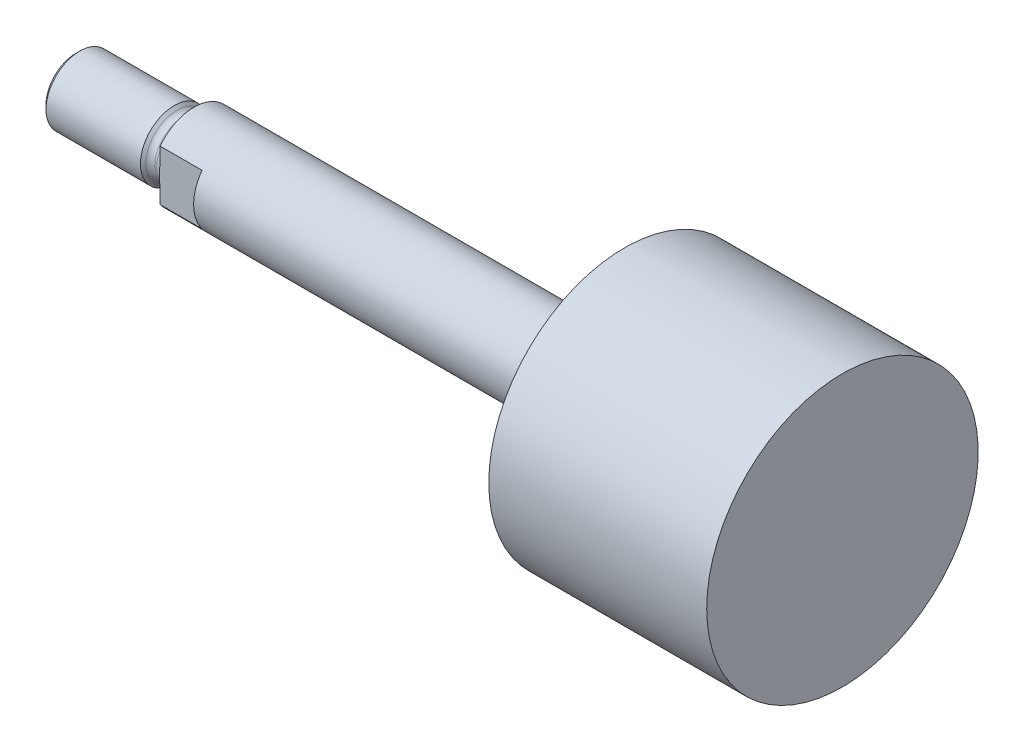
ISO-10303-21;
HEADER;
FILE_DESCRIPTION(('STEP AP214'),'2;1');
FILE_NAME('part.step','',(''),(''),'','','');
FILE_SCHEMA(('AUTOMOTIVE_DESIGN { 1 0 10303 214 1 1 1 1 }'));
ENDSEC;
DATA;
#1=APPLICATION_CONTEXT('core data for automotive mechanical design processes');
#2=APPLICATION_PROTOCOL_DEFINITION('international standard','automotive_design',2000,#1);
#3=PRODUCT_CONTEXT('',#1,'mechanical');
#4=PRODUCT('Part','Part','',(#3));
#5=PRODUCT_RELATED_PRODUCT_CATEGORY('part','',(#4));
#6=PRODUCT_DEFINITION_FORMATION('','',#4);
#7=PRODUCT_DEFINITION_CONTEXT('part definition',#1,'design');
#8=PRODUCT_DEFINITION('design','',#6,#7);
#9=PRODUCT_DEFINITION_SHAPE('','',#8);
#10=(LENGTH_UNIT() NAMED_UNIT(*) SI_UNIT(.MILLI.,.METRE.));
#11=(NAMED_UNIT(*) PLANE_ANGLE_UNIT() SI_UNIT($,.RADIAN.));
#12=(NAMED_UNIT(*) SI_UNIT($,.STERADIAN.) SOLID_ANGLE_UNIT());
#13=UNCERTAINTY_MEASURE_WITH_UNIT(LENGTH_MEASURE(1.E-05),#10,'distance_accuracy_value','');
#14=(GEOMETRIC_REPRESENTATION_CONTEXT(3) GLOBAL_UNCERTAINTY_ASSIGNED_CONTEXT((#13)) GLOBAL_UNIT_ASSIGNED_CONTEXT((#10,
#11,#12)) REPRESENTATION_CONTEXT('',''));
#15=CARTESIAN_POINT('',(0.,0.,0.));
#16=DIRECTION('',(0.,0.,1.));
#17=DIRECTION('',(1.,0.,0.));
#18=AXIS2_PLACEMENT_3D('',#15,#16,#17);
#19=CARTESIAN_POINT('',(-9.525,0.,0.));
#20=DIRECTION('',(1.,0.,0.));
#21=DIRECTION('',(0.,0.,-1.));
#22=AXIS2_PLACEMENT_3D('',#19,#20,#21);
#23=PLANE('',#22);
#24=CARTESIAN_POINT('',(-9.52500000000001,0.,0.));
#25=DIRECTION('',(-1.,0.,0.));
#26=DIRECTION('',(0.,0.,1.));
#27=AXIS2_PLACEMENT_3D('',#24,#25,#26);
#28=CIRCLE('',#27,7.9375);
#29=CARTESIAN_POINT('',(-9.52500000000001,-4.7625,-6.35));
#30=VERTEX_POINT('',#29);
#31=CARTESIAN_POINT('',(-9.52500000000001,-4.7625,6.35));
#32=VERTEX_POINT('',#31);
#33=EDGE_CURVE('E106',#30,#32,#28,.T.);
#34=ORIENTED_EDGE('',*,*,#33,.T.);
#35=DIRECTION('',(0.,1.,0.));
#36=VECTOR('',#35,1.);
#37=CARTESIAN_POINT('',(-9.525,0.,6.35));
#38=LINE('',#37,#36);
#39=CARTESIAN_POINT('',(-9.52499999999909,-2.97038855370794,6.35));
#40=VERTEX_POINT('',#39);
#41=EDGE_CURVE('E114',#32,#40,#38,.T.);
#42=ORIENTED_EDGE('',*,*,#41,.T.);
#43=CARTESIAN_POINT('',(-9.525,0.,0.));
#44=DIRECTION('',(-1.,0.,0.));
#45=DIRECTION('',(0.,0.,1.));
#46=AXIS2_PLACEMENT_3D('',#43,#44,#45);
#47=CIRCLE('',#46,7.01039999999997);
#48=CARTESIAN_POINT('',(-9.525,-2.970388553708,-6.35));
#49=VERTEX_POINT('',#48);
#50=EDGE_CURVE('E149',#49,#40,#47,.T.);
#51=ORIENTED_EDGE('',*,*,#50,.F.);
#52=DIRECTION('',(0.,-1.,0.));
#53=VECTOR('',#52,1.);
#54=CARTESIAN_POINT('',(-9.525,0.,-6.35));
#55=LINE('',#54,#53);
#56=EDGE_CURVE('E51',#49,#30,#55,.T.);
#57=ORIENTED_EDGE('',*,*,#56,.T.);
#58=EDGE_LOOP('',(#34,#42,#51,#57));
#59=FACE_BOUND('',#58,.T.);
#60=ADVANCED_FACE('F36',(#59),#23,.F.);
#61=CARTESIAN_POINT('',(-9.525,2.970388553708,6.35));
#62=VERTEX_POINT('',#61);
#63=CARTESIAN_POINT('',(-9.52499999999909,2.97038855370794,-6.35));
#64=VERTEX_POINT('',#63);
#65=EDGE_CURVE('E150',#62,#64,#47,.T.);
#66=ORIENTED_EDGE('',*,*,#65,.F.);
#67=CARTESIAN_POINT('',(-9.52500000000001,4.7625,6.35));
#68=VERTEX_POINT('',#67);
#69=EDGE_CURVE('E59',#62,#68,#38,.T.);
#70=ORIENTED_EDGE('',*,*,#69,.T.);
#71=CARTESIAN_POINT('',(-9.52500000000001,4.7625,-6.35));
#72=VERTEX_POINT('',#71);
#73=EDGE_CURVE('E147',#68,#72,#28,.T.);
#74=ORIENTED_EDGE('',*,*,#73,.T.);
#75=EDGE_CURVE('E107',#72,#64,#55,.T.);
#76=ORIENTED_EDGE('',*,*,#75,.T.);
#77=EDGE_LOOP('',(#66,#70,#74,#76));
#78=FACE_BOUND('',#77,.T.);
#79=ADVANCED_FACE('F38',(#78),#23,.F.);
#80=CARTESIAN_POINT('',(112.395,0.,0.));
#81=DIRECTION('',(-1.,0.,0.));
#82=DIRECTION('',(0.,0.,1.));
#83=AXIS2_PLACEMENT_3D('',#80,#81,#82);
#84=CYLINDRICAL_SURFACE('',#83,7.9375);
#85=DIRECTION('',(-1.,0.,0.));
#86=VECTOR('',#85,1.);
#87=CARTESIAN_POINT('',(112.395,4.7625,-6.35));
#88=LINE('',#87,#86);
#89=CARTESIAN_POINT('',(-1.651,4.7625,-6.35));
#90=VERTEX_POINT('',#89);
#91=EDGE_CURVE('E99',#90,#72,#88,.T.);
#92=ORIENTED_EDGE('',*,*,#91,.T.);
#93=ORIENTED_EDGE('',*,*,#73,.F.);
#94=DIRECTION('',(-1.,0.,0.));
#95=VECTOR('',#94,1.);
#96=CARTESIAN_POINT('',(112.395,4.7625,6.35));
#97=LINE('',#96,#95);
#98=CARTESIAN_POINT('',(-1.651,4.7625,6.35));
#99=VERTEX_POINT('',#98);
#100=EDGE_CURVE('E115',#68,#99,#97,.F.);
#101=ORIENTED_EDGE('',*,*,#100,.T.);
#102=CARTESIAN_POINT('',(-1.651,0.,0.));
#103=DIRECTION('',(1.,0.,0.));
#104=DIRECTION('',(0.,0.,-1.));
#105=AXIS2_PLACEMENT_3D('',#102,#103,#104);
#106=CIRCLE('',#105,7.9375);
#107=CARTESIAN_POINT('',(-1.651,-4.7625,6.35));
#108=VERTEX_POINT('',#107);
#109=EDGE_CURVE('E11',#99,#108,#106,.T.);
#110=ORIENTED_EDGE('',*,*,#109,.T.);
#111=DIRECTION('',(-1.,0.,0.));
#112=VECTOR('',#111,1.);
#113=CARTESIAN_POINT('',(112.395,-4.7625,6.35));
#114=LINE('',#113,#112);
#115=EDGE_CURVE('E118',#108,#32,#114,.T.);
#116=ORIENTED_EDGE('',*,*,#115,.T.);
#117=ORIENTED_EDGE('',*,*,#33,.F.);
#118=DIRECTION('',(-1.,0.,0.));
#119=VECTOR('',#118,1.);
#120=CARTESIAN_POINT('',(112.395,-4.7625,-6.35));
#121=LINE('',#120,#119);
#122=CARTESIAN_POINT('',(-1.651,-4.7625,-6.35));
#123=VERTEX_POINT('',#122);
#124=EDGE_CURVE('E97',#30,#123,#121,.F.);
#125=ORIENTED_EDGE('',*,*,#124,.T.);
#126=EDGE_CURVE('E40',#123,#90,#106,.T.);
#127=ORIENTED_EDGE('',*,*,#126,.T.);
#128=EDGE_LOOP('',(#92,#93,#101,#110,#116,#117,#125,#127));
#129=FACE_BOUND('',#128,.T.);
#130=CARTESIAN_POINT('',(71.4248,0.,0.));
#131=DIRECTION('',(-1.,0.,0.));
#132=DIRECTION('',(0.,0.,1.));
#133=AXIS2_PLACEMENT_3D('',#130,#131,#132);
#134=CIRCLE('',#133,7.9375);
#135=CARTESIAN_POINT('',(71.4248,0.,7.9375));
#136=VERTEX_POINT('',#135);
#137=EDGE_CURVE('E144',#136,#136,#134,.T.);
#138=ORIENTED_EDGE('',*,*,#137,.T.);
#139=EDGE_LOOP('',(#138));
#140=FACE_BOUND('',#139,.T.);
#141=ADVANCED_FACE('F103',(#129,#140),#84,.T.);
#142=CARTESIAN_POINT('',(71.4248,7.9375,0.));
#143=DIRECTION('',(1.,0.,0.));
#144=DIRECTION('',(0.,0.,-1.));
#145=AXIS2_PLACEMENT_3D('',#142,#143,#144);
#146=PLANE('',#145);
#147=ORIENTED_EDGE('',*,*,#137,.F.);
#148=EDGE_LOOP('',(#147));
#149=FACE_BOUND('',#148,.T.);
#150=CARTESIAN_POINT('',(71.4248,0.,0.));
#151=DIRECTION('',(-1.,0.,0.));
#152=DIRECTION('',(0.,0.,1.));
#153=AXIS2_PLACEMENT_3D('',#150,#151,#152);
#154=CIRCLE('',#153,25.52065);
#155=CARTESIAN_POINT('',(71.4248,0.,25.52065));
#156=VERTEX_POINT('',#155);
#157=EDGE_CURVE('E141',#156,#156,#154,.T.);
#158=ORIENTED_EDGE('',*,*,#157,.T.);
#159=EDGE_LOOP('',(#158));
#160=FACE_BOUND('',#159,.T.);
#161=ADVANCED_FACE('F223',(#149,#160),#146,.F.);
#162=CARTESIAN_POINT('',(112.395,0.,0.));
#163=DIRECTION('',(-1.,0.,0.));
#164=DIRECTION('',(0.,0.,1.));
#165=AXIS2_PLACEMENT_3D('',#162,#163,#164);
#166=CYLINDRICAL_SURFACE('',#165,25.52065);
#167=ORIENTED_EDGE('',*,*,#157,.F.);
#168=EDGE_LOOP('',(#167));
#169=FACE_BOUND('',#168,.T.);
#170=CARTESIAN_POINT('',(112.395,0.,0.));
#171=DIRECTION('',(-1.,0.,0.));
#172=DIRECTION('',(0.,0.,1.));
#173=AXIS2_PLACEMENT_3D('',#170,#171,#172);
#174=CIRCLE('',#173,25.52065);
#175=CARTESIAN_POINT('',(112.395,0.,25.52065));
#176=VERTEX_POINT('',#175);
#177=EDGE_CURVE('E138',#176,#176,#174,.T.);
#178=ORIENTED_EDGE('',*,*,#177,.T.);
#179=EDGE_LOOP('',(#178));
#180=FACE_BOUND('',#179,.T.);
#181=ADVANCED_FACE('F227',(#169,#180),#166,.T.);
#182=CARTESIAN_POINT('',(112.395,25.52065,0.));
#183=DIRECTION('',(-1.,0.,0.));
#184=DIRECTION('',(0.,0.,1.));
#185=AXIS2_PLACEMENT_3D('',#182,#183,#184);
#186=PLANE('',#185);
#187=ORIENTED_EDGE('',*,*,#177,.F.);
#188=EDGE_LOOP('',(#187));
#189=FACE_BOUND('',#188,.T.);
#190=ADVANCED_FACE('F200',(#189),#186,.F.);
#191=CARTESIAN_POINT('',(-11.176,0.,0.));
#192=DIRECTION('',(-1.,0.,0.));
#193=DIRECTION('',(0.,0.,1.));
#194=AXIS2_PLACEMENT_3D('',#191,#192,#193);
#195=TOROIDAL_SURFACE('',#194,7.01039999999997,1.65099999999996);
#196=CARTESIAN_POINT('',(-11.176,0.,0.));
#197=DIRECTION('',(-1.,0.,0.));
#198=DIRECTION('',(0.,0.,1.));
#199=AXIS2_PLACEMENT_3D('',#196,#197,#198);
#200=CIRCLE('',#199,5.3594);
#201=CARTESIAN_POINT('',(-11.176,0.,5.3594));
#202=VERTEX_POINT('',#201);
#203=EDGE_CURVE('E135',#202,#202,#200,.T.);
#204=ORIENTED_EDGE('',*,*,#203,.F.);
#205=EDGE_LOOP('',(#204));
#206=FACE_BOUND('',#205,.T.);
#207=ORIENTED_EDGE('',*,*,#50,.T.);
#208=CARTESIAN_POINT('',(-9.66283350552548,0.,6.35));
#209=CARTESIAN_POINT('',(-9.66283776268165,0.137451430435917,6.35));
#210=CARTESIAN_POINT('',(-9.66086064410943,0.274901459292685,6.35));
#211=CARTESIAN_POINT('',(-9.65327512758972,0.549703593251603,6.35));
#212=CARTESIAN_POINT('',(-9.64766654215389,0.687055692931226,6.35));
#213=CARTESIAN_POINT('',(-9.63368350744831,0.961784555362044,6.35));
#214=CARTESIAN_POINT('',(-9.62530558703981,1.09916113170582,6.35));
#215=CARTESIAN_POINT('',(-9.60709506531702,1.37381514567713,6.35));
#216=CARTESIAN_POINT('',(-9.59726243721363,1.51109258143215,6.35));
#217=CARTESIAN_POINT('',(-9.57769107415581,1.78610658716269,6.35));
#218=CARTESIAN_POINT('',(-9.56795275241811,1.92384318770572,6.35));
#219=CARTESIAN_POINT('',(-9.55036706332895,2.1994349590825,6.35));
#220=CARTESIAN_POINT('',(-9.54251954822724,2.33729011980641,6.35));
#221=CARTESIAN_POINT('',(-9.53061012777387,2.61293672942961,6.35));
#222=CARTESIAN_POINT('',(-9.52654157628171,2.75072786256873,6.35));
#223=CARTESIAN_POINT('',(-9.52417014087122,3.02639632048793,6.35));
#224=CARTESIAN_POINT('',(-9.52586736602664,3.16427364684923,6.35));
#225=CARTESIAN_POINT('',(-9.53623298695597,3.41591615679577,6.35));
#226=CARTESIAN_POINT('',(-9.54364547741073,3.52972902878415,6.35));
#227=CARTESIAN_POINT('',(-9.5652722959771,3.75668651680819,6.35));
#228=CARTESIAN_POINT('',(-9.57948360173495,3.8698314071859,6.35));
#229=CARTESIAN_POINT('',(-9.61613724000463,4.09430765509806,6.35));
#230=CARTESIAN_POINT('',(-9.63854290816065,4.20564481854687,6.35));
#231=CARTESIAN_POINT('',(-9.69323725421695,4.42580807481177,6.35));
#232=CARTESIAN_POINT('',(-9.72551563503527,4.53463665746051,6.35));
#233=CARTESIAN_POINT('',(-9.80043395264561,4.74434521790355,6.35));
#234=CARTESIAN_POINT('',(-9.84265936849043,4.84537030063758,6.35));
#235=CARTESIAN_POINT('',(-9.93986578771073,5.04143487335471,6.35));
#236=CARTESIAN_POINT('',(-9.99486731550324,5.13646441596393,6.35));
#237=CARTESIAN_POINT('',(-10.1200822564968,5.31808438255421,6.35));
#238=CARTESIAN_POINT('',(-10.1904956953232,5.40453978365148,6.35));
#239=CARTESIAN_POINT('',(-10.3469450411392,5.56188873080202,6.35));
#240=CARTESIAN_POINT('',(-10.4329191525452,5.63284146617137,6.35));
#241=CARTESIAN_POINT('',(-10.5840425675886,5.72981578158812,6.35));
#242=CARTESIAN_POINT('',(-10.6448142215812,5.76269017456242,6.35));
#243=CARTESIAN_POINT('',(-10.7709599511927,5.81803002255515,6.35));
#244=CARTESIAN_POINT('',(-10.8363311031553,5.84050202217993,6.35));
#245=CARTESIAN_POINT('',(-10.9704057837701,5.87363179910374,6.35));
#246=CARTESIAN_POINT('',(-11.0391250807995,5.88422658965699,6.35));
#247=CARTESIAN_POINT('',(-11.177340641629,5.89257253132415,6.35));
#248=CARTESIAN_POINT('',(-11.2468367101593,5.89032684097418,6.35));
#249=CARTESIAN_POINT('',(-11.3787070331634,5.87387551024288,6.35));
#250=CARTESIAN_POINT('',(-11.4412061552369,5.86064135459059,6.35));
#251=CARTESIAN_POINT('',(-11.5632476514794,5.82431208557844,6.35));
#252=CARTESIAN_POINT('',(-11.6227895241345,5.8012153059669,6.35));
#253=CARTESIAN_POINT('',(-11.7403800522129,5.74515145636776,6.35));
#254=CARTESIAN_POINT('',(-11.7982335897206,5.71177873804436,6.35));
#255=CARTESIAN_POINT('',(-11.9086295249029,5.63724297521669,6.35));
#256=CARTESIAN_POINT('',(-11.9611700546148,5.59607720531773,6.35));
#257=CARTESIAN_POINT('',(-12.0874929348829,5.48357026818756,6.35));
#258=CARTESIAN_POINT('',(-12.1574533423658,5.40792695476672,6.35));
#259=CARTESIAN_POINT('',(-12.2844713443971,5.24641974614602,6.35));
#260=CARTESIAN_POINT('',(-12.3414880796921,5.16052475647974,6.35));
#261=CARTESIAN_POINT('',(-12.4707359307792,4.9347664739624,6.35));
#262=CARTESIAN_POINT('',(-12.5350669449757,4.79038507098147,6.35));
#263=CARTESIAN_POINT('',(-12.6144952020883,4.56826751975704,6.35));
#264=CARTESIAN_POINT('',(-12.638128174757,4.49329586638908,6.35));
#265=CARTESIAN_POINT('',(-12.6803779181948,4.34194457273481,6.35));
#266=CARTESIAN_POINT('',(-12.6989955499358,4.26556517652083,6.35));
#267=CARTESIAN_POINT('',(-12.7564627847762,3.99639285228688,6.35));
#268=CARTESIAN_POINT('',(-12.7836807225018,3.80111803468868,6.35));
#269=CARTESIAN_POINT('',(-12.8184318392706,3.40880994621735,6.35));
#270=CARTESIAN_POINT('',(-12.8259262725631,3.21177397598197,6.35));
#271=CARTESIAN_POINT('',(-12.8278648104876,2.81615270361075,6.35));
#272=CARTESIAN_POINT('',(-12.822203365626,2.61756769884746,6.35));
#273=CARTESIAN_POINT('',(-12.8082768260479,2.32006340067763,6.35));
#274=CARTESIAN_POINT('',(-12.8027310743218,2.22098332552986,6.35));
#275=CARTESIAN_POINT('',(-12.7905166824336,2.02288471369804,6.35));
#276=CARTESIAN_POINT('',(-12.7838479756302,1.92386618101643,6.35));
#277=CARTESIAN_POINT('',(-12.7613349514935,1.60017235724012,6.35));
#278=CARTESIAN_POINT('',(-12.7445899147175,1.37556077876289,6.35));
#279=CARTESIAN_POINT('',(-12.7230317982697,1.03842412557191,6.35));
#280=CARTESIAN_POINT('',(-12.7164394586494,0.926019432621905,6.35));
#281=CARTESIAN_POINT('',(-12.7051111639391,0.701115546286717,6.35));
#282=CARTESIAN_POINT('',(-12.7003751781763,0.588616354493737,6.35));
#283=CARTESIAN_POINT('',(-12.6932629768874,0.363473765579382,6.35));
#284=CARTESIAN_POINT('',(-12.6908881622922,0.250830322504832,6.35));
#285=CARTESIAN_POINT('',(-12.68875509809,0.0255182719448549,6.35));
#286=CARTESIAN_POINT('',(-12.6889968378574,-0.0871503354365248,6.35));
#287=CARTESIAN_POINT('',(-12.6920714763423,-0.312454087984137,6.35));
#288=CARTESIAN_POINT('',(-12.6949044477263,-0.425089232123346,6.35));
#289=CARTESIAN_POINT('',(-12.702859514925,-0.650277280111182,6.35));
#290=CARTESIAN_POINT('',(-12.7079816432833,-0.762830182767846,6.35));
#291=CARTESIAN_POINT('',(-12.7199487366169,-0.987337547246309,6.35));
#292=CARTESIAN_POINT('',(-12.7267859120841,-1.09929243839208,6.35));
#293=CARTESIAN_POINT('',(-12.7414782767011,-1.32313641851737,6.35));
#294=CARTESIAN_POINT('',(-12.7493335032882,-1.43502550492493,6.35));
#295=CARTESIAN_POINT('',(-12.7731990641829,-1.77079830212964,6.35));
#296=CARTESIAN_POINT('',(-12.7895009673345,-1.9946645733859,6.35));
#297=CARTESIAN_POINT('',(-12.8152546426155,-2.44200235728095,6.35));
#298=CARTESIAN_POINT('',(-12.824731856633,-2.66547220536156,6.35));
#299=CARTESIAN_POINT('',(-12.8285644311114,-3.11258627813859,6.35));
#300=CARTESIAN_POINT('',(-12.8229360134774,-3.33623005813547,6.35));
#301=CARTESIAN_POINT('',(-12.7957533131104,-3.67283380754169,6.35));
#302=CARTESIAN_POINT('',(-12.783320036777,-3.78650376318378,6.35));
#303=CARTESIAN_POINT('',(-12.7504854781607,-4.01266196471474,6.35));
#304=CARTESIAN_POINT('',(-12.7300889094231,-4.12515086930589,6.35));
#305=CARTESIAN_POINT('',(-12.6798834273822,-4.3470965353313,6.35));
#306=CARTESIAN_POINT('',(-12.6501525292717,-4.45657053075977,6.35));
#307=CARTESIAN_POINT('',(-12.5794709705848,-4.67174541894533,6.35));
#308=CARTESIAN_POINT('',(-12.5385385562476,-4.77745213446833,6.35));
#309=CARTESIAN_POINT('',(-12.4516351540539,-4.96532049264913,6.35));
#310=CARTESIAN_POINT('',(-12.407716610098,-5.04842137561528,6.35));
#311=CARTESIAN_POINT('',(-12.3096287719324,-5.20870266710894,6.35));
#312=CARTESIAN_POINT('',(-12.2554371656012,-5.2858696652362,6.35));
#313=CARTESIAN_POINT('',(-12.1354148508841,-5.43202630027439,6.35));
#314=CARTESIAN_POINT('',(-12.0694720967193,-5.50092545654871,6.35));
#315=CARTESIAN_POINT('',(-11.9262295337076,-5.62563283051266,6.35));
#316=CARTESIAN_POINT('',(-11.8489621166341,-5.68147724394676,6.35));
#317=CARTESIAN_POINT('',(-11.7079156806997,-5.76216217571648,6.35));
#318=CARTESIAN_POINT('',(-11.646593515351,-5.79130212879009,6.35));
#319=CARTESIAN_POINT('',(-11.5199401018597,-5.83902667369762,6.35));
#320=CARTESIAN_POINT('',(-11.4546109583345,-5.85761675500087,6.35));
#321=CARTESIAN_POINT('',(-11.3213878911029,-5.88304336115577,6.35));
#322=CARTESIAN_POINT('',(-11.2534842556745,-5.88982964849793,6.35));
#323=CARTESIAN_POINT('',(-11.1175731001094,-5.89098078699452,6.35));
#324=CARTESIAN_POINT('',(-11.0495655926506,-5.8853470491712,6.35));
#325=CARTESIAN_POINT('',(-10.9200907696854,-5.86286503384324,6.35));
#326=CARTESIAN_POINT('',(-10.8584878193056,-5.84678035988086,6.35));
#327=CARTESIAN_POINT('',(-10.7385994363608,-5.80513696231909,6.35));
#328=CARTESIAN_POINT('',(-10.68031455109,-5.7795766809701,6.35));
#329=CARTESIAN_POINT('',(-10.5642917052381,-5.71828161732367,6.35));
#330=CARTESIAN_POINT('',(-10.5068582878686,-5.68197486941694,6.35));
#331=CARTESIAN_POINT('',(-10.3976123655063,-5.60176026396359,6.35));
#332=CARTESIAN_POINT('',(-10.3458029673299,-5.55784823952845,6.35));
#333=CARTESIAN_POINT('',(-10.2197492885202,-5.43686373126916,6.35));
#334=CARTESIAN_POINT('',(-10.149821452742,-5.35528312172123,6.35));
#335=CARTESIAN_POINT('',(-10.0237833120175,-5.18206063648093,6.35));
#336=CARTESIAN_POINT('',(-9.96770968653939,-5.09039296195431,6.35));
#337=CARTESIAN_POINT('',(-9.84027609825545,-4.84784321098991,6.35));
#338=CARTESIAN_POINT('',(-9.77773645162136,-4.69236222508176,6.35));
#339=CARTESIAN_POINT('',(-9.67665394886215,-4.37406719343418,6.35));
#340=CARTESIAN_POINT('',(-9.63814724832736,-4.21124249234669,6.35));
#341=CARTESIAN_POINT('',(-9.57948258130468,-3.8819011686035,6.35));
#342=CARTESIAN_POINT('',(-9.55938898295512,-3.71537366330788,6.35));
#343=CARTESIAN_POINT('',(-9.53300586548555,-3.38116647429116,6.35));
#344=CARTESIAN_POINT('',(-9.52673257260309,-3.21348566784267,6.35));
#345=CARTESIAN_POINT('',(-9.52389368450728,-2.87751190999647,6.35));
#346=CARTESIAN_POINT('',(-9.52736299967132,-2.70921892080532,6.35));
#347=CARTESIAN_POINT('',(-9.54036574077566,-2.37285550482285,6.35));
#348=CARTESIAN_POINT('',(-9.54990116184465,-2.2047851694934,6.35));
#349=CARTESIAN_POINT('',(-9.57174049297751,-1.86677913570174,6.35));
#350=CARTESIAN_POINT('',(-9.58407680105693,-1.69684573220966,6.35));
#351=CARTESIAN_POINT('',(-9.60216542880539,-1.44190520142448,6.35));
#352=CARTESIAN_POINT('',(-9.60812600147519,-1.35691332422046,6.35));
#353=CARTESIAN_POINT('',(-9.61954733466145,-1.18688855561919,6.35));
#354=CARTESIAN_POINT('',(-9.62500805078837,-1.10185566125219,6.35));
#355=CARTESIAN_POINT('',(-9.64007476287685,-0.847506710481027,6.35));
#356=CARTESIAN_POINT('',(-9.64843102002812,-0.678110208580065,6.35));
#357=CARTESIAN_POINT('',(-9.6598074598334,-0.339141745197648,6.35));
#358=CARTESIAN_POINT('',(-9.66282825359654,-0.169569806036713,6.35));
#359=CARTESIAN_POINT('',(-9.66283350552548,0.,6.35));
#360=B_SPLINE_CURVE_WITH_KNOTS('',3,(#208,#209,#210,#211,#212,#213,#214,#215,#216,#217,#218,
#219,#220,#221,#222,#223,#224,#225,#226,#227,#228,#229,#230,#231,#232,#233,#234,#235,#236,#237,
#238,#239,#240,#241,#242,#243,#244,#245,#246,#247,#248,#249,#250,#251,#252,#253,#254,#255,#256,
#257,#258,#259,#260,#261,#262,#263,#264,#265,#266,#267,#268,#269,#270,#271,#272,#273,#274,#275,
#276,#277,#278,#279,#280,#281,#282,#283,#284,#285,#286,#287,#288,#289,#290,#291,#292,#293,#294,
#295,#296,#297,#298,#299,#300,#301,#302,#303,#304,#305,#306,#307,#308,#309,#310,#311,#312,#313,
#314,#315,#316,#317,#318,#319,#320,#321,#322,#323,#324,#325,#326,#327,#328,#329,#330,#331,#332,
#333,#334,#335,#336,#337,#338,#339,#340,#341,#342,#343,#344,#345,#346,#347,#348,#349,#350,#351,
#352,#353,#354,#355,#356,#357,#358,#359),.UNSPECIFIED.,.T.,.F.,(4,2,2,2,2,2,2,2,2,2,2,2,2,2,2,2,
2,2,2,2,2,2,2,2,2,2,2,2,2,2,2,2,2,2,2,2,2,2,2,2,2,2,2,2,2,2,2,2,2,2,2,2,2,2,2,2,2,2,2,2,2,2,2,2,
2,2,2,2,2,2,2,2,2,2,2,4),(0.,0.412339289241474,0.82469986877127,1.23757928152648,
1.65046629859163,2.06470618720891,2.47891369604228,2.89239134260297,3.30587681114709,
3.64787871847947,3.98972873293334,4.33006754206839,4.67005258674404,4.99780695703714,
5.32609154090036,5.6589202652331,5.99045513633344,6.19693216053688,6.4032791037515,
6.61071523639147,6.81810034552774,7.00888932115543,7.1997105425936,7.39932155940348,
7.59900251379466,7.90635186614279,8.21465833866274,8.68601032191178,8.92173621674306,
9.15742161922938,9.74722950164081,10.3381951676506,10.9339184971833,11.2316247306027,
11.529348637493,12.205041815419,12.5428239307086,12.8806004645301,13.2185772886789,
13.556552740329,13.8945376701643,14.2325274050839,14.5690089854144,14.9055029429119,
15.5788606415283,16.2496949359733,16.9198091112626,17.2626319612836,17.605252198235,
17.945081845498,18.2843612030263,18.5657318084249,18.8477206748317,19.1325581351394,
19.4165962281368,19.6194515274012,19.8222011769102,20.0258116462341,20.2293989848401,
20.4195682300957,20.6097687522412,20.812854409184,21.0160516896715,21.3365618817821,
21.6579117546663,22.1578306867135,22.6584999041801,23.1609127471135,23.663915152643,
24.1687222481481,24.6736954594784,25.1848376488363,25.4404385872892,25.6960622022881,
26.2048113872837,26.7135022977838),.UNSPECIFIED.);
#361=EDGE_CURVE('E95',#40,#62,#360,.T.);
#362=ORIENTED_EDGE('',*,*,#361,.T.);
#363=ORIENTED_EDGE('',*,*,#65,.T.);
#364=CARTESIAN_POINT('',(-9.66283350552548,0.,-6.35));
#365=CARTESIAN_POINT('',(-9.66283776268165,-0.137451430435917,-6.35));
#366=CARTESIAN_POINT('',(-9.66086064410943,-0.274901459292685,-6.35));
#367=CARTESIAN_POINT('',(-9.65327512758972,-0.549703593251603,-6.35));
#368=CARTESIAN_POINT('',(-9.64766654215389,-0.687055692931226,-6.35));
#369=CARTESIAN_POINT('',(-9.63368350744831,-0.961784555362044,-6.35));
#370=CARTESIAN_POINT('',(-9.62530558703981,-1.09916113170582,-6.35));
#371=CARTESIAN_POINT('',(-9.60709506531702,-1.37381514567713,-6.35));
#372=CARTESIAN_POINT('',(-9.59726243721363,-1.51109258143215,-6.35));
#373=CARTESIAN_POINT('',(-9.57769107415581,-1.78610658716269,-6.35));
#374=CARTESIAN_POINT('',(-9.56795275241811,-1.92384318770572,-6.35));
#375=CARTESIAN_POINT('',(-9.55036706332895,-2.1994349590825,-6.35));
#376=CARTESIAN_POINT('',(-9.54251954822724,-2.33729011980641,-6.35));
#377=CARTESIAN_POINT('',(-9.53061012777387,-2.61293672942961,-6.35));
#378=CARTESIAN_POINT('',(-9.52654157628171,-2.75072786256873,-6.35));
#379=CARTESIAN_POINT('',(-9.52417014087122,-3.02639632048793,-6.35));
#380=CARTESIAN_POINT('',(-9.52586736602664,-3.16427364684923,-6.35));
#381=CARTESIAN_POINT('',(-9.53623298695597,-3.41591615679577,-6.35));
#382=CARTESIAN_POINT('',(-9.54364547741073,-3.52972902878415,-6.35));
#383=CARTESIAN_POINT('',(-9.5652722959771,-3.75668651680819,-6.35));
#384=CARTESIAN_POINT('',(-9.57948360173495,-3.8698314071859,-6.35));
#385=CARTESIAN_POINT('',(-9.61613724000463,-4.09430765509806,-6.35));
#386=CARTESIAN_POINT('',(-9.63854290816065,-4.20564481854687,-6.35));
#387=CARTESIAN_POINT('',(-9.69323725421695,-4.42580807481177,-6.35));
#388=CARTESIAN_POINT('',(-9.72551563503527,-4.53463665746051,-6.35));
#389=CARTESIAN_POINT('',(-9.80043395264561,-4.74434521790355,-6.35));
#390=CARTESIAN_POINT('',(-9.84265936849043,-4.84537030063758,-6.35));
#391=CARTESIAN_POINT('',(-9.93986578771073,-5.04143487335471,-6.35));
#392=CARTESIAN_POINT('',(-9.99486731550324,-5.13646441596393,-6.35));
#393=CARTESIAN_POINT('',(-10.1200822564968,-5.31808438255421,-6.35));
#394=CARTESIAN_POINT('',(-10.1904956953232,-5.40453978365148,-6.35));
#395=CARTESIAN_POINT('',(-10.3469450411392,-5.56188873080202,-6.35));
#396=CARTESIAN_POINT('',(-10.4329191525452,-5.63284146617137,-6.35));
#397=CARTESIAN_POINT('',(-10.5840425675886,-5.72981578158812,-6.35));
#398=CARTESIAN_POINT('',(-10.6448142215812,-5.76269017456242,-6.35));
#399=CARTESIAN_POINT('',(-10.7709599511927,-5.81803002255515,-6.35));
#400=CARTESIAN_POINT('',(-10.8363311031553,-5.84050202217993,-6.35));
#401=CARTESIAN_POINT('',(-10.9704057837701,-5.87363179910374,-6.35));
#402=CARTESIAN_POINT('',(-11.0391250807995,-5.88422658965699,-6.35));
#403=CARTESIAN_POINT('',(-11.177340641629,-5.89257253132415,-6.35));
#404=CARTESIAN_POINT('',(-11.2468367101593,-5.89032684097418,-6.35));
#405=CARTESIAN_POINT('',(-11.3787070331634,-5.87387551024288,-6.35));
#406=CARTESIAN_POINT('',(-11.4412061552369,-5.86064135459059,-6.35));
#407=CARTESIAN_POINT('',(-11.5632476514794,-5.82431208557844,-6.35));
#408=CARTESIAN_POINT('',(-11.6227895241345,-5.8012153059669,-6.35));
#409=CARTESIAN_POINT('',(-11.7403800522129,-5.74515145636776,-6.35));
#410=CARTESIAN_POINT('',(-11.7982335897206,-5.71177873804436,-6.35));
#411=CARTESIAN_POINT('',(-11.9086295249029,-5.63724297521669,-6.35));
#412=CARTESIAN_POINT('',(-11.9611700546148,-5.59607720531773,-6.35));
#413=CARTESIAN_POINT('',(-12.0874929348829,-5.48357026818756,-6.35));
#414=CARTESIAN_POINT('',(-12.1574533423658,-5.40792695476672,-6.35));
#415=CARTESIAN_POINT('',(-12.2844713443971,-5.24641974614602,-6.35));
#416=CARTESIAN_POINT('',(-12.3414880796921,-5.16052475647974,-6.35));
#417=CARTESIAN_POINT('',(-12.4707359307792,-4.9347664739624,-6.35));
#418=CARTESIAN_POINT('',(-12.5350669449757,-4.79038507098147,-6.35));
#419=CARTESIAN_POINT('',(-12.6144952020883,-4.56826751975704,-6.35));
#420=CARTESIAN_POINT('',(-12.638128174757,-4.49329586638908,-6.35));
#421=CARTESIAN_POINT('',(-12.6803779181948,-4.34194457273481,-6.35));
#422=CARTESIAN_POINT('',(-12.6989955499358,-4.26556517652083,-6.35));
#423=CARTESIAN_POINT('',(-12.7564627847762,-3.99639285228688,-6.35));
#424=CARTESIAN_POINT('',(-12.7836807225018,-3.80111803468868,-6.35));
#425=CARTESIAN_POINT('',(-12.8184318392706,-3.40880994621735,-6.35));
#426=CARTESIAN_POINT('',(-12.8259262725631,-3.21177397598197,-6.35));
#427=CARTESIAN_POINT('',(-12.8278648104876,-2.81615270361075,-6.35));
#428=CARTESIAN_POINT('',(-12.822203365626,-2.61756769884746,-6.35));
#429=CARTESIAN_POINT('',(-12.8082768260479,-2.32006340067763,-6.35));
#430=CARTESIAN_POINT('',(-12.8027310743218,-2.22098332552986,-6.35));
#431=CARTESIAN_POINT('',(-12.7905166824336,-2.02288471369804,-6.35));
#432=CARTESIAN_POINT('',(-12.7838479756302,-1.92386618101643,-6.35));
#433=CARTESIAN_POINT('',(-12.7613349514935,-1.60017235724012,-6.35));
#434=CARTESIAN_POINT('',(-12.7445899147175,-1.37556077876289,-6.35));
#435=CARTESIAN_POINT('',(-12.7230317982697,-1.03842412557191,-6.35));
#436=CARTESIAN_POINT('',(-12.7164394586494,-0.926019432621905,-6.35));
#437=CARTESIAN_POINT('',(-12.7051111639391,-0.701115546286717,-6.35));
#438=CARTESIAN_POINT('',(-12.7003751781763,-0.588616354493737,-6.35));
#439=CARTESIAN_POINT('',(-12.6932629768874,-0.363473765579382,-6.35));
#440=CARTESIAN_POINT('',(-12.6908881622922,-0.250830322504832,-6.35));
#441=CARTESIAN_POINT('',(-12.68875509809,-0.0255182719448549,-6.35));
#442=CARTESIAN_POINT('',(-12.6889968378574,0.0871503354365248,-6.35));
#443=CARTESIAN_POINT('',(-12.6920714763423,0.312454087984137,-6.35));
#444=CARTESIAN_POINT('',(-12.6949044477263,0.425089232123346,-6.35));
#445=CARTESIAN_POINT('',(-12.702859514925,0.650277280111182,-6.35));
#446=CARTESIAN_POINT('',(-12.7079816432833,0.762830182767846,-6.35));
#447=CARTESIAN_POINT('',(-12.7199487366169,0.987337547246309,-6.35));
#448=CARTESIAN_POINT('',(-12.7267859120841,1.09929243839208,-6.35));
#449=CARTESIAN_POINT('',(-12.7414782767011,1.32313641851737,-6.35));
#450=CARTESIAN_POINT('',(-12.7493335032882,1.43502550492493,-6.35));
#451=CARTESIAN_POINT('',(-12.7731990641829,1.77079830212964,-6.35));
#452=CARTESIAN_POINT('',(-12.7895009673345,1.9946645733859,-6.35));
#453=CARTESIAN_POINT('',(-12.8152546426155,2.44200235728095,-6.35));
#454=CARTESIAN_POINT('',(-12.824731856633,2.66547220536156,-6.35));
#455=CARTESIAN_POINT('',(-12.8285644311114,3.11258627813859,-6.35));
#456=CARTESIAN_POINT('',(-12.8229360134774,3.33623005813547,-6.35));
#457=CARTESIAN_POINT('',(-12.7957533131104,3.67283380754169,-6.35));
#458=CARTESIAN_POINT('',(-12.783320036777,3.78650376318378,-6.35));
#459=CARTESIAN_POINT('',(-12.7504854781607,4.01266196471474,-6.35));
#460=CARTESIAN_POINT('',(-12.7300889094231,4.12515086930589,-6.35));
#461=CARTESIAN_POINT('',(-12.6798834273822,4.3470965353313,-6.35));
#462=CARTESIAN_POINT('',(-12.6501525292717,4.45657053075977,-6.35));
#463=CARTESIAN_POINT('',(-12.5794709705848,4.67174541894533,-6.35));
#464=CARTESIAN_POINT('',(-12.5385385562476,4.77745213446833,-6.35));
#465=CARTESIAN_POINT('',(-12.4516351540539,4.96532049264913,-6.35));
#466=CARTESIAN_POINT('',(-12.407716610098,5.04842137561528,-6.35));
#467=CARTESIAN_POINT('',(-12.3096287719324,5.20870266710894,-6.35));
#468=CARTESIAN_POINT('',(-12.2554371656012,5.2858696652362,-6.35));
#469=CARTESIAN_POINT('',(-12.1354148508841,5.43202630027439,-6.35));
#470=CARTESIAN_POINT('',(-12.0694720967193,5.50092545654871,-6.35));
#471=CARTESIAN_POINT('',(-11.9262295337076,5.62563283051266,-6.35));
#472=CARTESIAN_POINT('',(-11.8489621166341,5.68147724394676,-6.35));
#473=CARTESIAN_POINT('',(-11.7079156806997,5.76216217571648,-6.35));
#474=CARTESIAN_POINT('',(-11.646593515351,5.79130212879009,-6.35));
#475=CARTESIAN_POINT('',(-11.5199401018597,5.83902667369762,-6.35));
#476=CARTESIAN_POINT('',(-11.4546109583345,5.85761675500087,-6.35));
#477=CARTESIAN_POINT('',(-11.3213878911029,5.88304336115577,-6.35));
#478=CARTESIAN_POINT('',(-11.2534842556745,5.88982964849793,-6.35));
#479=CARTESIAN_POINT('',(-11.1175731001094,5.89098078699452,-6.35));
#480=CARTESIAN_POINT('',(-11.0495655926506,5.8853470491712,-6.35));
#481=CARTESIAN_POINT('',(-10.9200907696854,5.86286503384324,-6.35));
#482=CARTESIAN_POINT('',(-10.8584878193056,5.84678035988086,-6.35));
#483=CARTESIAN_POINT('',(-10.7385994363608,5.80513696231909,-6.35));
#484=CARTESIAN_POINT('',(-10.68031455109,5.7795766809701,-6.35));
#485=CARTESIAN_POINT('',(-10.5642917052381,5.71828161732367,-6.35));
#486=CARTESIAN_POINT('',(-10.5068582878686,5.68197486941694,-6.35));
#487=CARTESIAN_POINT('',(-10.3976123655063,5.60176026396359,-6.35));
#488=CARTESIAN_POINT('',(-10.3458029673299,5.55784823952845,-6.35));
#489=CARTESIAN_POINT('',(-10.2197492885202,5.43686373126916,-6.35));
#490=CARTESIAN_POINT('',(-10.149821452742,5.35528312172123,-6.35));
#491=CARTESIAN_POINT('',(-10.0237833120175,5.18206063648093,-6.35));
#492=CARTESIAN_POINT('',(-9.96770968653939,5.09039296195431,-6.35));
#493=CARTESIAN_POINT('',(-9.84027609825545,4.84784321098991,-6.35));
#494=CARTESIAN_POINT('',(-9.77773645162136,4.69236222508176,-6.35));
#495=CARTESIAN_POINT('',(-9.67665394886215,4.37406719343418,-6.35));
#496=CARTESIAN_POINT('',(-9.63814724832736,4.21124249234669,-6.35));
#497=CARTESIAN_POINT('',(-9.57948258130468,3.8819011686035,-6.35));
#498=CARTESIAN_POINT('',(-9.55938898295512,3.71537366330788,-6.35));
#499=CARTESIAN_POINT('',(-9.53300586548555,3.38116647429116,-6.35));
#500=CARTESIAN_POINT('',(-9.52673257260309,3.21348566784267,-6.35));
#501=CARTESIAN_POINT('',(-9.52389368450728,2.87751190999647,-6.35));
#502=CARTESIAN_POINT('',(-9.52736299967132,2.70921892080532,-6.35));
#503=CARTESIAN_POINT('',(-9.54036574077566,2.37285550482285,-6.35));
#504=CARTESIAN_POINT('',(-9.54990116184465,2.2047851694934,-6.35));
#505=CARTESIAN_POINT('',(-9.57174049297751,1.86677913570174,-6.35));
#506=CARTESIAN_POINT('',(-9.58407680105693,1.69684573220966,-6.35));
#507=CARTESIAN_POINT('',(-9.60216542880539,1.44190520142448,-6.35));
#508=CARTESIAN_POINT('',(-9.60812600147519,1.35691332422046,-6.35));
#509=CARTESIAN_POINT('',(-9.61954733466145,1.18688855561919,-6.35));
#510=CARTESIAN_POINT('',(-9.62500805078837,1.10185566125219,-6.35));
#511=CARTESIAN_POINT('',(-9.64007476287685,0.847506710481027,-6.35));
#512=CARTESIAN_POINT('',(-9.64843102002812,0.678110208580065,-6.35));
#513=CARTESIAN_POINT('',(-9.6598074598334,0.339141745197648,-6.35));
#514=CARTESIAN_POINT('',(-9.66282825359654,0.169569806036713,-6.35));
#515=CARTESIAN_POINT('',(-9.66283350552548,0.,-6.35));
#516=B_SPLINE_CURVE_WITH_KNOTS('',3,(#364,#365,#366,#367,#368,#369,#370,#371,#372,#373,#374,
#375,#376,#377,#378,#379,#380,#381,#382,#383,#384,#385,#386,#387,#388,#389,#390,#391,#392,#393,
#394,#395,#396,#397,#398,#399,#400,#401,#402,#403,#404,#405,#406,#407,#408,#409,#410,#411,#412,
#413,#414,#415,#416,#417,#418,#419,#420,#421,#422,#423,#424,#425,#426,#427,#428,#429,#430,#431,
#432,#433,#434,#435,#436,#437,#438,#439,#440,#441,#442,#443,#444,#445,#446,#447,#448,#449,#450,
#451,#452,#453,#454,#455,#456,#457,#458,#459,#460,#461,#462,#463,#464,#465,#466,#467,#468,#469,
#470,#471,#472,#473,#474,#475,#476,#477,#478,#479,#480,#481,#482,#483,#484,#485,#486,#487,#488,
#489,#490,#491,#492,#493,#494,#495,#496,#497,#498,#499,#500,#501,#502,#503,#504,#505,#506,#507,
#508,#509,#510,#511,#512,#513,#514,#515),.UNSPECIFIED.,.T.,.F.,(4,2,2,2,2,2,2,2,2,2,2,2,2,2,2,2,
2,2,2,2,2,2,2,2,2,2,2,2,2,2,2,2,2,2,2,2,2,2,2,2,2,2,2,2,2,2,2,2,2,2,2,2,2,2,2,2,2,2,2,2,2,2,2,2,
2,2,2,2,2,2,2,2,2,2,2,4),(0.,0.412339289241474,0.82469986877127,1.23757928152648,
1.65046629859163,2.06470618720891,2.47891369604228,2.89239134260297,3.30587681114709,
3.64787871847947,3.98972873293334,4.33006754206839,4.67005258674404,4.99780695703714,
5.32609154090036,5.6589202652331,5.99045513633344,6.19693216053688,6.4032791037515,
6.61071523639147,6.81810034552774,7.00888932115543,7.1997105425936,7.39932155940348,
7.59900251379466,7.90635186614279,8.21465833866274,8.68601032191178,8.92173621674306,
9.15742161922938,9.74722950164081,10.3381951676506,10.9339184971833,11.2316247306027,
11.529348637493,12.205041815419,12.5428239307086,12.8806004645301,13.2185772886789,
13.556552740329,13.8945376701643,14.2325274050839,14.5690089854144,14.9055029429119,
15.5788606415283,16.2496949359733,16.9198091112626,17.2626319612836,17.605252198235,
17.945081845498,18.2843612030263,18.5657318084249,18.8477206748317,19.1325581351394,
19.4165962281368,19.6194515274012,19.8222011769102,20.0258116462341,20.2293989848401,
20.4195682300957,20.6097687522412,20.812854409184,21.0160516896715,21.3365618817821,
21.6579117546663,22.1578306867135,22.6584999041801,23.1609127471135,23.663915152643,
24.1687222481481,24.6736954594784,25.1848376488363,25.4404385872892,25.6960622022881,
26.2048113872837,26.7135022977838),.UNSPECIFIED.);
#517=EDGE_CURVE('E153',#64,#49,#516,.T.);
#518=ORIENTED_EDGE('',*,*,#517,.T.);
#519=EDGE_LOOP('',(#207,#362,#363,#518));
#520=FACE_BOUND('',#519,.T.);
#521=ADVANCED_FACE('F161',(#206,#520),#195,.F.);
#522=CARTESIAN_POINT('',(-9.525,0.,0.));
#523=DIRECTION('',(-1.,0.,0.));
#524=DIRECTION('',(0.,0.,1.));
#525=AXIS2_PLACEMENT_3D('',#522,#523,#524);
#526=CYLINDRICAL_SURFACE('',#525,5.3594);
#527=CARTESIAN_POINT('',(-11.558933408522,0.,0.));
#528=DIRECTION('',(-1.,0.,0.));
#529=DIRECTION('',(0.,0.,1.));
#530=AXIS2_PLACEMENT_3D('',#527,#528,#529);
#531=CIRCLE('',#530,5.3594);
#532=CARTESIAN_POINT('',(-11.558933408522,0.,5.3594));
#533=VERTEX_POINT('',#532);
#534=EDGE_CURVE('E132',#533,#533,#531,.T.);
#535=ORIENTED_EDGE('',*,*,#534,.F.);
#536=EDGE_LOOP('',(#535));
#537=FACE_BOUND('',#536,.T.);
#538=ORIENTED_EDGE('',*,*,#203,.T.);
#539=EDGE_LOOP('',(#538));
#540=FACE_BOUND('',#539,.T.);
#541=ADVANCED_FACE('F193',(#537,#540),#526,.T.);
#542=CARTESIAN_POINT('',(-11.5589334085223,0.,0.));
#543=DIRECTION('',(-1.,0.,0.));
#544=DIRECTION('',(0.,0.,1.));
#545=AXIS2_PLACEMENT_3D('',#542,#543,#544);
#546=TOROIDAL_SURFACE('',#545,7.01039999999939,1.65099999999939);
#547=CARTESIAN_POINT('',(-12.726366704261,0.,0.));
#548=DIRECTION('',(-1.,0.,0.));
#549=DIRECTION('',(0.,0.,1.));
#550=AXIS2_PLACEMENT_3D('',#547,#548,#549);
#551=CIRCLE('',#550,5.842966704261);
#552=CARTESIAN_POINT('',(-12.726366704261,0.,5.842966704261));
#553=VERTEX_POINT('',#552);
#554=EDGE_CURVE('E129',#553,#553,#551,.T.);
#555=ORIENTED_EDGE('',*,*,#554,.F.);
#556=EDGE_LOOP('',(#555));
#557=FACE_BOUND('',#556,.T.);
#558=ORIENTED_EDGE('',*,*,#534,.T.);
#559=EDGE_LOOP('',(#558));
#560=FACE_BOUND('',#559,.T.);
#561=ADVANCED_FACE('F190',(#557,#560),#546,.F.);
#562=CARTESIAN_POINT('',(-12.726366704261,0.,0.));
#563=DIRECTION('',(-1.,0.,0.));
#564=DIRECTION('',(0.,0.,1.));
#565=AXIS2_PLACEMENT_3D('',#562,#563,#564);
#566=CONICAL_SURFACE('',#565,5.842966704261,0.78539816339745);
#567=CARTESIAN_POINT('',(-13.2334,0.,0.));
#568=DIRECTION('',(-1.,0.,0.));
#569=DIRECTION('',(0.,0.,1.));
#570=AXIS2_PLACEMENT_3D('',#567,#568,#569);
#571=CIRCLE('',#570,6.35);
#572=CARTESIAN_POINT('',(-13.2334,0.,6.35));
#573=VERTEX_POINT('',#572);
#574=EDGE_CURVE('E126',#573,#573,#571,.T.);
#575=ORIENTED_EDGE('',*,*,#574,.F.);
#576=EDGE_LOOP('',(#575));
#577=FACE_BOUND('',#576,.T.);
#578=ORIENTED_EDGE('',*,*,#554,.T.);
#579=EDGE_LOOP('',(#578));
#580=FACE_BOUND('',#579,.T.);
#581=ADVANCED_FACE('F186',(#577,#580),#566,.T.);
#582=CARTESIAN_POINT('',(-9.525,0.,0.));
#583=DIRECTION('',(-1.,0.,0.));
#584=DIRECTION('',(0.,0.,1.));
#585=AXIS2_PLACEMENT_3D('',#582,#583,#584);
#586=CYLINDRICAL_SURFACE('',#585,6.35);
#587=CARTESIAN_POINT('',(-30.99435,0.,0.));
#588=DIRECTION('',(-1.,0.,0.));
#589=DIRECTION('',(0.,0.,1.));
#590=AXIS2_PLACEMENT_3D('',#587,#588,#589);
#591=CIRCLE('',#590,6.35);
#592=CARTESIAN_POINT('',(-30.99435,0.,6.35));
#593=VERTEX_POINT('',#592);
#594=EDGE_CURVE('E123',#593,#593,#591,.T.);
#595=ORIENTED_EDGE('',*,*,#594,.F.);
#596=EDGE_LOOP('',(#595));
#597=FACE_BOUND('',#596,.T.);
#598=ORIENTED_EDGE('',*,*,#574,.T.);
#599=EDGE_LOOP('',(#598));
#600=FACE_BOUND('',#599,.T.);
#601=ADVANCED_FACE('F182',(#597,#600),#586,.T.);
#602=CARTESIAN_POINT('',(-30.99435,0.,0.));
#603=DIRECTION('',(1.,0.,0.));
#604=DIRECTION('',(0.,0.,-1.));
#605=AXIS2_PLACEMENT_3D('',#602,#603,#604);
#606=CONICAL_SURFACE('',#605,6.35,0.785398163397445);
#607=CARTESIAN_POINT('',(-31.75,0.,0.));
#608=DIRECTION('',(-1.,0.,0.));
#609=DIRECTION('',(0.,0.,1.));
#610=AXIS2_PLACEMENT_3D('',#607,#608,#609);
#611=CIRCLE('',#610,5.59435);
#612=CARTESIAN_POINT('',(-31.75,0.,5.59435));
#613=VERTEX_POINT('',#612);
#614=EDGE_CURVE('E120',#613,#613,#611,.T.);
#615=ORIENTED_EDGE('',*,*,#614,.F.);
#616=EDGE_LOOP('',(#615));
#617=FACE_BOUND('',#616,.T.);
#618=ORIENTED_EDGE('',*,*,#594,.T.);
#619=EDGE_LOOP('',(#618));
#620=FACE_BOUND('',#619,.T.);
#621=ADVANCED_FACE('F178',(#617,#620),#606,.T.);
#622=CARTESIAN_POINT('',(-31.75,0.,0.));
#623=DIRECTION('',(1.,0.,0.));
#624=DIRECTION('',(0.,0.,-1.));
#625=AXIS2_PLACEMENT_3D('',#622,#623,#624);
#626=PLANE('',#625);
#627=ORIENTED_EDGE('',*,*,#614,.T.);
#628=EDGE_LOOP('',(#627));
#629=FACE_BOUND('',#628,.T.);
#630=ADVANCED_FACE('F167',(#629),#626,.F.);
#631=CARTESIAN_POINT('',(-1.651,-7.9375,-6.35));
#632=DIRECTION('',(0.,0.,1.));
#633=DIRECTION('',(1.,0.,0.));
#634=AXIS2_PLACEMENT_3D('',#631,#632,#633);
#635=PLANE('',#634);
#636=DIRECTION('',(0.,1.,0.));
#637=VECTOR('',#636,1.);
#638=CARTESIAN_POINT('',(-1.651,-7.9375,-6.35));
#639=LINE('',#638,#637);
#640=EDGE_CURVE('E91',#123,#90,#639,.T.);
#641=ORIENTED_EDGE('',*,*,#640,.F.);
#642=ORIENTED_EDGE('',*,*,#124,.F.);
#643=ORIENTED_EDGE('',*,*,#56,.F.);
#644=ORIENTED_EDGE('',*,*,#517,.F.);
#645=ORIENTED_EDGE('',*,*,#75,.F.);
#646=ORIENTED_EDGE('',*,*,#91,.F.);
#647=EDGE_LOOP('',(#641,#642,#643,#644,#645,#646));
#648=FACE_BOUND('',#647,.T.);
#649=ADVANCED_FACE('F96',(#648),#635,.F.);
#650=CARTESIAN_POINT('',(-1.651,0.,0.));
#651=DIRECTION('',(1.,0.,0.));
#652=DIRECTION('',(0.,0.,-1.));
#653=AXIS2_PLACEMENT_3D('',#650,#651,#652);
#654=PLANE('',#653);
#655=ORIENTED_EDGE('',*,*,#640,.T.);
#656=ORIENTED_EDGE('',*,*,#126,.F.);
#657=EDGE_LOOP('',(#655,#656));
#658=FACE_BOUND('',#657,.T.);
#659=ADVANCED_FACE('F90',(#658),#654,.F.);
#660=DIRECTION('',(0.,-1.,0.));
#661=VECTOR('',#660,1.);
#662=CARTESIAN_POINT('',(-1.651,7.9375,6.35));
#663=LINE('',#662,#661);
#664=EDGE_CURVE('E100',#99,#108,#663,.T.);
#665=ORIENTED_EDGE('',*,*,#664,.T.);
#666=ORIENTED_EDGE('',*,*,#109,.F.);
#667=EDGE_LOOP('',(#665,#666));
#668=FACE_BOUND('',#667,.T.);
#669=ADVANCED_FACE('F172',(#668),#654,.F.);
#670=CARTESIAN_POINT('',(-1.651,7.9375,6.35));
#671=DIRECTION('',(0.,0.,-1.));
#672=DIRECTION('',(-1.,0.,0.));
#673=AXIS2_PLACEMENT_3D('',#670,#671,#672);
#674=PLANE('',#673);
#675=ORIENTED_EDGE('',*,*,#664,.F.);
#676=ORIENTED_EDGE('',*,*,#100,.F.);
#677=ORIENTED_EDGE('',*,*,#69,.F.);
#678=ORIENTED_EDGE('',*,*,#361,.F.);
#679=ORIENTED_EDGE('',*,*,#41,.F.);
#680=ORIENTED_EDGE('',*,*,#115,.F.);
#681=EDGE_LOOP('',(#675,#676,#677,#678,#679,#680));
#682=FACE_BOUND('',#681,.T.);
#683=ADVANCED_FACE('F168',(#682),#674,.F.);
#684=CLOSED_SHELL('',(#60,#79,#141,#161,#181,#190,#521,#541,#561,#581,#601,#621,#630,#649,#659,
#669,#683));
#685=MANIFOLD_SOLID_BREP('B2',#684);
#686=ADVANCED_BREP_SHAPE_REPRESENTATION('',(#18,#685),#14);
#687=SHAPE_DEFINITION_REPRESENTATION(#9,#686);
ENDSEC;
END-ISO-10303-21;
